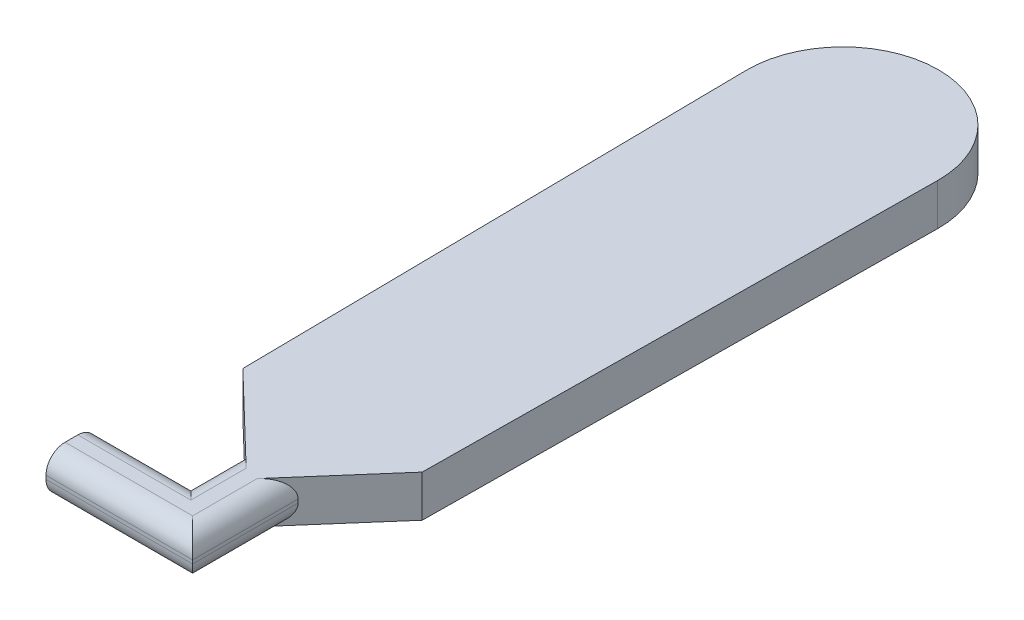
ISO-10303-21;
HEADER;
FILE_DESCRIPTION(('STEP AP214'),'2;1');
FILE_NAME('part.step','',(''),(''),'','','');
FILE_SCHEMA(('AUTOMOTIVE_DESIGN { 1 0 10303 214 1 1 1 1 }'));
ENDSEC;
DATA;
#1=APPLICATION_CONTEXT('core data for automotive mechanical design processes');
#2=APPLICATION_PROTOCOL_DEFINITION('international standard','automotive_design',2000,#1);
#3=PRODUCT_CONTEXT('',#1,'mechanical');
#4=PRODUCT('Part','Part','',(#3));
#5=PRODUCT_RELATED_PRODUCT_CATEGORY('part','',(#4));
#6=PRODUCT_DEFINITION_FORMATION('','',#4);
#7=PRODUCT_DEFINITION_CONTEXT('part definition',#1,'design');
#8=PRODUCT_DEFINITION('design','',#6,#7);
#9=PRODUCT_DEFINITION_SHAPE('','',#8);
#10=(LENGTH_UNIT() NAMED_UNIT(*) SI_UNIT(.MILLI.,.METRE.));
#11=(NAMED_UNIT(*) PLANE_ANGLE_UNIT() SI_UNIT($,.RADIAN.));
#12=(NAMED_UNIT(*) SI_UNIT($,.STERADIAN.) SOLID_ANGLE_UNIT());
#13=UNCERTAINTY_MEASURE_WITH_UNIT(LENGTH_MEASURE(1.E-05),#10,'distance_accuracy_value','');
#14=(GEOMETRIC_REPRESENTATION_CONTEXT(3) GLOBAL_UNCERTAINTY_ASSIGNED_CONTEXT((#13)) GLOBAL_UNIT_ASSIGNED_CONTEXT((#10,
#11,#12)) REPRESENTATION_CONTEXT('',''));
#15=CARTESIAN_POINT('',(0.,0.,0.));
#16=DIRECTION('',(0.,0.,1.));
#17=DIRECTION('',(1.,0.,0.));
#18=AXIS2_PLACEMENT_3D('',#15,#16,#17);
#19=CARTESIAN_POINT('',(8.67320172340913,10.,-0.111731628823776));
#20=DIRECTION('',(-0.999917032248953,0.,0.0128813282873694));
#21=DIRECTION('',(0.0128813282873694,0.,0.999917032248953));
#22=AXIS2_PLACEMENT_3D('',#19,#20,#21);
#23=PLANE('',#22);
#24=DIRECTION('',(-0.0128813282873694,0.,-0.999917032248953));
#25=VECTOR('',#24,1.);
#26=CARTESIAN_POINT('',(8.67320172340913,0.,-0.111731628823776));
#27=LINE('',#26,#25);
#28=CARTESIAN_POINT('',(7.67302590939626,0.,-77.7506838675886));
#29=VERTEX_POINT('',#28);
#30=CARTESIAN_POINT('',(6.09883614107377,0.,-199.947644167181));
#31=VERTEX_POINT('',#30);
#32=EDGE_CURVE('E163',#29,#31,#27,.T.);
#33=ORIENTED_EDGE('',*,*,#32,.F.);
#34=DIRECTION('',(0.,-1.,0.));
#35=VECTOR('',#34,1.);
#36=CARTESIAN_POINT('',(7.67302590939626,10.,-77.7506838675886));
#37=LINE('',#36,#35);
#38=CARTESIAN_POINT('',(7.67302590939626,10.,-77.7506838675886));
#39=VERTEX_POINT('',#38);
#40=EDGE_CURVE('E158',#39,#29,#37,.T.);
#41=ORIENTED_EDGE('',*,*,#40,.F.);
#42=DIRECTION('',(-0.0128813282873694,0.,-0.999917032248953));
#43=VECTOR('',#42,1.);
#44=CARTESIAN_POINT('',(8.67320172340913,10.,-0.111731628823776));
#45=LINE('',#44,#43);
#46=CARTESIAN_POINT('',(6.09883614107377,10.,-199.947644167181));
#47=VERTEX_POINT('',#46);
#48=EDGE_CURVE('E161',#39,#47,#45,.T.);
#49=ORIENTED_EDGE('',*,*,#48,.T.);
#50=DIRECTION('',(0.,-1.,0.));
#51=VECTOR('',#50,1.);
#52=CARTESIAN_POINT('',(6.09883614107377,10.,-199.947644167181));
#53=LINE('',#52,#51);
#54=EDGE_CURVE('E195',#47,#31,#53,.T.);
#55=ORIENTED_EDGE('',*,*,#54,.T.);
#56=EDGE_LOOP('',(#33,#41,#49,#55));
#57=FACE_BOUND('',#56,.T.);
#58=ADVANCED_FACE('F43',(#57),#23,.T.);
#59=CARTESIAN_POINT('',(42.5354193090019,10.,-44.2050407153228));
#60=DIRECTION('',(0.693367619628063,0.,-0.720584029833658));
#61=DIRECTION('',(-0.720584029833658,0.,-0.693367619628063));
#62=AXIS2_PLACEMENT_3D('',#59,#60,#61);
#63=PLANE('',#62);
#64=DIRECTION('',(0.720584029833658,0.,0.693367619628063));
#65=VECTOR('',#64,1.);
#66=CARTESIAN_POINT('',(42.5354193090019,0.,-44.2050407153228));
#67=LINE('',#66,#65);
#68=CARTESIAN_POINT('',(28.76441124198,0.,-57.4559187364662));
#69=VERTEX_POINT('',#68);
#70=EDGE_CURVE('E197',#29,#69,#67,.T.);
#71=ORIENTED_EDGE('',*,*,#70,.T.);
#72=CARTESIAN_POINT('',(28.76441124198,4.572,-57.4559187364662));
#73=DIRECTION('',(0.693367619628063,0.,-0.720584029833658));
#74=DIRECTION('',(0.720584029833658,0.,0.693367619628063));
#75=AXIS2_PLACEMENT_3D('',#72,#73,#74);
#76=ELLIPSE('',#75,6.34485335604151,4.572);
#77=CARTESIAN_POINT('',(24.19241124198,4.572,-61.8552346048338));
#78=VERTEX_POINT('',#77);
#79=EDGE_CURVE('E52',#69,#78,#76,.T.);
#80=ORIENTED_EDGE('',*,*,#79,.T.);
#81=DIRECTION('',(0.,-1.,0.));
#82=VECTOR('',#81,1.);
#83=CARTESIAN_POINT('',(24.19241124198,10.,-61.8552346048338));
#84=LINE('',#83,#82);
#85=CARTESIAN_POINT('',(24.19241124198,5.428,-61.8552346048338));
#86=VERTEX_POINT('',#85);
#87=EDGE_CURVE('E166',#86,#78,#84,.T.);
#88=ORIENTED_EDGE('',*,*,#87,.F.);
#89=CARTESIAN_POINT('',(28.76441124198,5.428,-57.4559187364662));
#90=DIRECTION('',(0.693367619628063,0.,-0.720584029833658));
#91=DIRECTION('',(-0.720584029833658,0.,-0.693367619628063));
#92=AXIS2_PLACEMENT_3D('',#89,#90,#91);
#93=ELLIPSE('',#92,6.34485335604151,4.572);
#94=CARTESIAN_POINT('',(28.76441124198,10.,-57.4559187364662));
#95=VERTEX_POINT('',#94);
#96=EDGE_CURVE('E11',#86,#95,#93,.T.);
#97=ORIENTED_EDGE('',*,*,#96,.T.);
#98=DIRECTION('',(0.720584029833658,0.,0.693367619628063));
#99=VECTOR('',#98,1.);
#100=CARTESIAN_POINT('',(42.5354193090019,10.,-44.2050407153228));
#101=LINE('',#100,#99);
#102=EDGE_CURVE('E168',#39,#95,#101,.T.);
#103=ORIENTED_EDGE('',*,*,#102,.F.);
#104=ORIENTED_EDGE('',*,*,#40,.T.);
#105=EDGE_LOOP('',(#71,#80,#88,#97,#103,#104));
#106=FACE_BOUND('',#105,.T.);
#107=ADVANCED_FACE('F169',(#106),#63,.F.);
#108=CARTESIAN_POINT('',(24.19241124198,10.,0.));
#109=DIRECTION('',(1.,0.,0.));
#110=DIRECTION('',(0.,0.,-1.));
#111=AXIS2_PLACEMENT_3D('',#108,#109,#110);
#112=PLANE('',#111);
#113=ORIENTED_EDGE('',*,*,#87,.T.);
#114=DIRECTION('',(0.,0.,1.));
#115=VECTOR('',#114,1.);
#116=CARTESIAN_POINT('',(24.19241124198,4.572,0.));
#117=LINE('',#116,#115);
#118=CARTESIAN_POINT('',(24.19241124198,4.572,-48.7662679513612));
#119=VERTEX_POINT('',#118);
#120=EDGE_CURVE('E265',#78,#119,#117,.T.);
#121=ORIENTED_EDGE('',*,*,#120,.T.);
#122=DIRECTION('',(0.,-1.,0.));
#123=VECTOR('',#122,1.);
#124=CARTESIAN_POINT('',(24.19241124198,10.,-48.7662679513612));
#125=LINE('',#124,#123);
#126=CARTESIAN_POINT('',(24.19241124198,5.428,-48.7662679513612));
#127=VERTEX_POINT('',#126);
#128=EDGE_CURVE('E225',#127,#119,#125,.T.);
#129=ORIENTED_EDGE('',*,*,#128,.F.);
#130=DIRECTION('',(0.,0.,1.));
#131=VECTOR('',#130,1.);
#132=CARTESIAN_POINT('',(24.19241124198,5.428,-61.8552346048338));
#133=LINE('',#132,#131);
#134=EDGE_CURVE('E66',#127,#86,#133,.F.);
#135=ORIENTED_EDGE('',*,*,#134,.T.);
#136=EDGE_LOOP('',(#113,#121,#129,#135));
#137=FACE_BOUND('',#136,.T.);
#138=ADVANCED_FACE('F337',(#137),#112,.F.);
#139=CARTESIAN_POINT('',(0.,10.,-48.7662679513612));
#140=DIRECTION('',(0.,0.,1.));
#141=DIRECTION('',(1.,0.,0.));
#142=AXIS2_PLACEMENT_3D('',#139,#140,#141);
#143=PLANE('',#142);
#144=ORIENTED_EDGE('',*,*,#128,.T.);
#145=DIRECTION('',(-1.,0.,0.));
#146=VECTOR('',#145,1.);
#147=CARTESIAN_POINT('',(0.,4.572,-48.7662679513612));
#148=LINE('',#147,#146);
#149=CARTESIAN_POINT('',(1.67291809905842,4.572,-48.7662679513612));
#150=VERTEX_POINT('',#149);
#151=EDGE_CURVE('E270',#119,#150,#148,.T.);
#152=ORIENTED_EDGE('',*,*,#151,.T.);
#153=DIRECTION('',(0.,-1.,0.));
#154=VECTOR('',#153,1.);
#155=CARTESIAN_POINT('',(1.67291809905842,10.,-48.7662679513612));
#156=LINE('',#155,#154);
#157=CARTESIAN_POINT('',(1.67291809905842,5.428,-48.7662679513612));
#158=VERTEX_POINT('',#157);
#159=EDGE_CURVE('E222',#158,#150,#156,.T.);
#160=ORIENTED_EDGE('',*,*,#159,.F.);
#161=DIRECTION('',(-1.,0.,0.));
#162=VECTOR('',#161,1.);
#163=CARTESIAN_POINT('',(24.19241124198,5.428,-48.7662679513612));
#164=LINE('',#163,#162);
#165=EDGE_CURVE('E268',#158,#127,#164,.F.);
#166=ORIENTED_EDGE('',*,*,#165,.T.);
#167=EDGE_LOOP('',(#144,#152,#160,#166));
#168=FACE_BOUND('',#167,.T.);
#169=ADVANCED_FACE('F339',(#168),#143,.F.);
#170=CARTESIAN_POINT('',(1.67291809905842,10.,0.));
#171=DIRECTION('',(1.,0.,0.));
#172=DIRECTION('',(0.,0.,-1.));
#173=AXIS2_PLACEMENT_3D('',#170,#171,#172);
#174=PLANE('',#173);
#175=DIRECTION('',(0.,-1.,0.));
#176=VECTOR('',#175,1.);
#177=CARTESIAN_POINT('',(1.67291809905842,10.,-36.5645685473484));
#178=LINE('',#177,#176);
#179=CARTESIAN_POINT('',(1.67291809905842,5.428,-36.5645685473484));
#180=VERTEX_POINT('',#179);
#181=CARTESIAN_POINT('',(1.67291809905842,4.572,-36.5645685473484));
#182=VERTEX_POINT('',#181);
#183=EDGE_CURVE('E219',#180,#182,#178,.T.);
#184=ORIENTED_EDGE('',*,*,#183,.F.);
#185=CARTESIAN_POINT('',(1.67291809905842,5.428,-41.1365685473484));
#186=DIRECTION('',(1.,0.,0.));
#187=DIRECTION('',(0.,0.,-1.));
#188=AXIS2_PLACEMENT_3D('',#185,#186,#187);
#189=CIRCLE('',#188,4.572);
#190=CARTESIAN_POINT('',(1.67291809905842,10.,-41.1365685473484));
#191=VERTEX_POINT('',#190);
#192=EDGE_CURVE('E249',#180,#191,#189,.F.);
#193=ORIENTED_EDGE('',*,*,#192,.T.);
#194=DIRECTION('',(0.,0.,1.));
#195=VECTOR('',#194,1.);
#196=CARTESIAN_POINT('',(1.67291809905842,10.,0.));
#197=LINE('',#196,#195);
#198=CARTESIAN_POINT('',(1.67291809905842,10.,-44.1942679513612));
#199=VERTEX_POINT('',#198);
#200=EDGE_CURVE('E174',#199,#191,#197,.T.);
#201=ORIENTED_EDGE('',*,*,#200,.F.);
#202=CARTESIAN_POINT('',(1.67291809905842,5.428,-44.1942679513612));
#203=DIRECTION('',(1.,0.,0.));
#204=DIRECTION('',(0.,0.,-1.));
#205=AXIS2_PLACEMENT_3D('',#202,#203,#204);
#206=CIRCLE('',#205,4.572);
#207=EDGE_CURVE('E243',#199,#158,#206,.F.);
#208=ORIENTED_EDGE('',*,*,#207,.T.);
#209=ORIENTED_EDGE('',*,*,#159,.T.);
#210=CARTESIAN_POINT('',(1.67291809905842,4.572,-44.1942679513612));
#211=DIRECTION('',(1.,0.,0.));
#212=DIRECTION('',(0.,0.,-1.));
#213=AXIS2_PLACEMENT_3D('',#210,#211,#212);
#214=CIRCLE('',#213,4.572);
#215=CARTESIAN_POINT('',(1.67291809905842,0.,-44.1942679513612));
#216=VERTEX_POINT('',#215);
#217=EDGE_CURVE('E245',#150,#216,#214,.F.);
#218=ORIENTED_EDGE('',*,*,#217,.T.);
#219=DIRECTION('',(0.,0.,1.));
#220=VECTOR('',#219,1.);
#221=CARTESIAN_POINT('',(1.67291809905842,0.,0.));
#222=LINE('',#221,#220);
#223=CARTESIAN_POINT('',(1.67291809905842,0.,-41.1365685473484));
#224=VERTEX_POINT('',#223);
#225=EDGE_CURVE('E200',#216,#224,#222,.T.);
#226=ORIENTED_EDGE('',*,*,#225,.T.);
#227=CARTESIAN_POINT('',(1.67291809905842,4.572,-41.1365685473484));
#228=DIRECTION('',(1.,0.,0.));
#229=DIRECTION('',(0.,0.,-1.));
#230=AXIS2_PLACEMENT_3D('',#227,#228,#229);
#231=CIRCLE('',#230,4.572);
#232=EDGE_CURVE('E247',#224,#182,#231,.F.);
#233=ORIENTED_EDGE('',*,*,#232,.T.);
#234=EDGE_LOOP('',(#184,#193,#201,#208,#209,#218,#226,#233));
#235=FACE_BOUND('',#234,.T.);
#236=ADVANCED_FACE('F297',(#235),#174,.F.);
#237=CARTESIAN_POINT('',(0.,10.,-36.5645685473484));
#238=DIRECTION('',(0.,0.,-1.));
#239=DIRECTION('',(-1.,0.,0.));
#240=AXIS2_PLACEMENT_3D('',#237,#238,#239);
#241=PLANE('',#240);
#242=DIRECTION('',(0.,-1.,0.));
#243=VECTOR('',#242,1.);
#244=CARTESIAN_POINT('',(36.8166245477847,10.,-36.5645685473484));
#245=LINE('',#244,#243);
#246=CARTESIAN_POINT('',(36.8166245477847,5.428,-36.5645685473484));
#247=VERTEX_POINT('',#246);
#248=CARTESIAN_POINT('',(36.8166245477847,4.572,-36.5645685473484));
#249=VERTEX_POINT('',#248);
#250=EDGE_CURVE('E216',#247,#249,#245,.T.);
#251=ORIENTED_EDGE('',*,*,#250,.F.);
#252=DIRECTION('',(1.,0.,0.));
#253=VECTOR('',#252,1.);
#254=CARTESIAN_POINT('',(1.67291809905842,5.428,-36.5645685473484));
#255=LINE('',#254,#253);
#256=EDGE_CURVE('E241',#247,#180,#255,.F.);
#257=ORIENTED_EDGE('',*,*,#256,.T.);
#258=ORIENTED_EDGE('',*,*,#183,.T.);
#259=DIRECTION('',(1.,0.,0.));
#260=VECTOR('',#259,1.);
#261=CARTESIAN_POINT('',(0.,4.572,-36.5645685473484));
#262=LINE('',#261,#260);
#263=EDGE_CURVE('E238',#182,#249,#262,.T.);
#264=ORIENTED_EDGE('',*,*,#263,.T.);
#265=EDGE_LOOP('',(#251,#257,#258,#264));
#266=FACE_BOUND('',#265,.T.);
#267=ADVANCED_FACE('F324',(#266),#241,.F.);
#268=CARTESIAN_POINT('',(36.8166245477847,10.,0.));
#269=DIRECTION('',(-1.,0.,0.));
#270=DIRECTION('',(0.,0.,1.));
#271=AXIS2_PLACEMENT_3D('',#268,#269,#270);
#272=PLANE('',#271);
#273=DIRECTION('',(0.,-1.,0.));
#274=VECTOR('',#273,1.);
#275=CARTESIAN_POINT('',(36.8166245477847,10.,-61.8552346048338));
#276=LINE('',#275,#274);
#277=CARTESIAN_POINT('',(36.8166245477847,5.428,-61.8552346048338));
#278=VERTEX_POINT('',#277);
#279=CARTESIAN_POINT('',(36.8166245477847,4.572,-61.8552346048338));
#280=VERTEX_POINT('',#279);
#281=EDGE_CURVE('E213',#278,#280,#276,.T.);
#282=ORIENTED_EDGE('',*,*,#281,.F.);
#283=DIRECTION('',(0.,0.,-1.));
#284=VECTOR('',#283,1.);
#285=CARTESIAN_POINT('',(36.8166245477847,5.428,-36.5645685473484));
#286=LINE('',#285,#284);
#287=EDGE_CURVE('E262',#278,#247,#286,.F.);
#288=ORIENTED_EDGE('',*,*,#287,.T.);
#289=ORIENTED_EDGE('',*,*,#250,.T.);
#290=DIRECTION('',(0.,0.,-1.));
#291=VECTOR('',#290,1.);
#292=CARTESIAN_POINT('',(36.8166245477847,4.572,0.));
#293=LINE('',#292,#291);
#294=EDGE_CURVE('E260',#249,#280,#293,.T.);
#295=ORIENTED_EDGE('',*,*,#294,.T.);
#296=EDGE_LOOP('',(#282,#288,#289,#295));
#297=FACE_BOUND('',#296,.T.);
#298=ADVANCED_FACE('F315',(#297),#272,.F.);
#299=CARTESIAN_POINT('',(-9.72544141948012,10.,-8.48044875271906));
#300=DIRECTION('',(-0.753701371654878,0.,-0.65721704357507));
#301=DIRECTION('',(-0.65721704357507,0.,0.753701371654878));
#302=AXIS2_PLACEMENT_3D('',#299,#300,#301);
#303=PLANE('',#302);
#304=DIRECTION('',(0.65721704357507,0.,-0.753701371654878));
#305=VECTOR('',#304,1.);
#306=CARTESIAN_POINT('',(-9.72544141948012,0.,-8.48044875271906));
#307=LINE('',#306,#305);
#308=CARTESIAN_POINT('',(32.2446245477847,0.,-56.6120311534119));
#309=VERTEX_POINT('',#308);
#310=CARTESIAN_POINT('',(50.677233754091,0.,-77.7506838675886));
#311=VERTEX_POINT('',#310);
#312=EDGE_CURVE('E203',#309,#311,#307,.T.);
#313=ORIENTED_EDGE('',*,*,#312,.T.);
#314=DIRECTION('',(0.,-1.,0.));
#315=VECTOR('',#314,1.);
#316=CARTESIAN_POINT('',(50.677233754091,10.,-77.7506838675886));
#317=LINE('',#316,#315);
#318=CARTESIAN_POINT('',(50.677233754091,10.,-77.7506838675886));
#319=VERTEX_POINT('',#318);
#320=EDGE_CURVE('E211',#319,#311,#317,.T.);
#321=ORIENTED_EDGE('',*,*,#320,.F.);
#322=DIRECTION('',(0.65721704357507,0.,-0.753701371654878));
#323=VECTOR('',#322,1.);
#324=CARTESIAN_POINT('',(-9.72544141948012,10.,-8.48044875271906));
#325=LINE('',#324,#323);
#326=CARTESIAN_POINT('',(32.2446245477847,10.,-56.6120311534119));
#327=VERTEX_POINT('',#326);
#328=EDGE_CURVE('E189',#327,#319,#325,.T.);
#329=ORIENTED_EDGE('',*,*,#328,.F.);
#330=CARTESIAN_POINT('',(32.2446245477847,5.428,-56.6120311534119));
#331=DIRECTION('',(-0.753701371654878,0.,-0.65721704357507));
#332=DIRECTION('',(-0.65721704357507,0.,0.753701371654878));
#333=AXIS2_PLACEMENT_3D('',#330,#331,#332);
#334=ELLIPSE('',#333,6.9566059564275,4.572);
#335=EDGE_CURVE('E272',#327,#278,#334,.T.);
#336=ORIENTED_EDGE('',*,*,#335,.T.);
#337=ORIENTED_EDGE('',*,*,#281,.T.);
#338=CARTESIAN_POINT('',(32.2446245477847,4.572,-56.6120311534119));
#339=DIRECTION('',(-0.753701371654878,0.,-0.65721704357507));
#340=DIRECTION('',(0.65721704357507,0.,-0.753701371654878));
#341=AXIS2_PLACEMENT_3D('',#338,#339,#340);
#342=ELLIPSE('',#341,6.9566059564275,4.572);
#343=EDGE_CURVE('E274',#280,#309,#342,.T.);
#344=ORIENTED_EDGE('',*,*,#343,.T.);
#345=EDGE_LOOP('',(#313,#321,#329,#336,#337,#344));
#346=FACE_BOUND('',#345,.T.);
#347=ADVANCED_FACE('F312',(#346),#303,.F.);
#348=CARTESIAN_POINT('',(49.8783176600329,10.,0.509182961049452));
#349=DIRECTION('',(0.999947897304426,0.,0.0102079712213835));
#350=DIRECTION('',(0.0102079712213835,0.,-0.999947897304426));
#351=AXIS2_PLACEMENT_3D('',#348,#349,#350);
#352=PLANE('',#351);
#353=DIRECTION('',(-0.0102079712213835,0.,0.999947897304426));
#354=VECTOR('',#353,1.);
#355=CARTESIAN_POINT('',(49.8783176600329,0.,0.509182961049452));
#356=LINE('',#355,#354);
#357=CARTESIAN_POINT('',(51.925307170323,0.,-200.008903564416));
#358=VERTEX_POINT('',#357);
#359=EDGE_CURVE('E185',#358,#311,#356,.T.);
#360=ORIENTED_EDGE('',*,*,#359,.F.);
#361=DIRECTION('',(0.,-1.,0.));
#362=VECTOR('',#361,1.);
#363=CARTESIAN_POINT('',(51.925307170323,10.,-200.008903564416));
#364=LINE('',#363,#362);
#365=CARTESIAN_POINT('',(51.925307170323,10.,-200.008903564416));
#366=VERTEX_POINT('',#365);
#367=EDGE_CURVE('E209',#366,#358,#364,.T.);
#368=ORIENTED_EDGE('',*,*,#367,.F.);
#369=DIRECTION('',(-0.0102079712213835,0.,0.999947897304426));
#370=VECTOR('',#369,1.);
#371=CARTESIAN_POINT('',(49.8783176600329,10.,0.509182961049452));
#372=LINE('',#371,#370);
#373=EDGE_CURVE('E191',#366,#319,#372,.T.);
#374=ORIENTED_EDGE('',*,*,#373,.T.);
#375=ORIENTED_EDGE('',*,*,#320,.T.);
#376=EDGE_LOOP('',(#360,#368,#374,#375));
#377=FACE_BOUND('',#376,.T.);
#378=ADVANCED_FACE('F426',(#377),#352,.T.);
#379=CARTESIAN_POINT('',(29.0117180226731,10.,-200.242817010535));
#380=DIRECTION('',(0.,-1.,0.));
#381=DIRECTION('',(0.,0.,-1.));
#382=AXIS2_PLACEMENT_3D('',#379,#380,#381);
#383=CYLINDRICAL_SURFACE('',#382,22.9147830696163);
#384=CARTESIAN_POINT('',(29.0117180226731,0.,-200.242817010535));
#385=DIRECTION('',(0.,1.,0.));
#386=DIRECTION('',(0.,0.,1.));
#387=AXIS2_PLACEMENT_3D('',#384,#385,#386);
#388=CIRCLE('',#387,22.9147830696163);
#389=EDGE_CURVE('E182',#358,#31,#388,.T.);
#390=ORIENTED_EDGE('',*,*,#389,.T.);
#391=ORIENTED_EDGE('',*,*,#54,.F.);
#392=CARTESIAN_POINT('',(29.0117180226731,10.,-200.242817010535));
#393=DIRECTION('',(0.,1.,0.));
#394=DIRECTION('',(0.,0.,1.));
#395=AXIS2_PLACEMENT_3D('',#392,#393,#394);
#396=CIRCLE('',#395,22.9147830696163);
#397=EDGE_CURVE('E180',#366,#47,#396,.T.);
#398=ORIENTED_EDGE('',*,*,#397,.F.);
#399=ORIENTED_EDGE('',*,*,#367,.T.);
#400=EDGE_LOOP('',(#390,#391,#398,#399));
#401=FACE_BOUND('',#400,.T.);
#402=ADVANCED_FACE('F417',(#401),#383,.T.);
#403=CARTESIAN_POINT('',(0.,10.,0.));
#404=DIRECTION('',(0.,1.,0.));
#405=DIRECTION('',(0.,0.,1.));
#406=AXIS2_PLACEMENT_3D('',#403,#404,#405);
#407=PLANE('',#406);
#408=ORIENTED_EDGE('',*,*,#200,.T.);
#409=DIRECTION('',(1.,0.,0.));
#410=VECTOR('',#409,1.);
#411=CARTESIAN_POINT('',(36.8166245477847,10.,-41.1365685473484));
#412=LINE('',#411,#410);
#413=CARTESIAN_POINT('',(32.2446245477847,10.,-41.1365685473484));
#414=VERTEX_POINT('',#413);
#415=EDGE_CURVE('E235',#191,#414,#412,.T.);
#416=ORIENTED_EDGE('',*,*,#415,.T.);
#417=DIRECTION('',(0.,0.,-1.));
#418=VECTOR('',#417,1.);
#419=CARTESIAN_POINT('',(32.2446245477847,10.,-61.8552346048338));
#420=LINE('',#419,#418);
#421=EDGE_CURVE('E232',#414,#327,#420,.T.);
#422=ORIENTED_EDGE('',*,*,#421,.T.);
#423=ORIENTED_EDGE('',*,*,#328,.T.);
#424=ORIENTED_EDGE('',*,*,#373,.F.);
#425=ORIENTED_EDGE('',*,*,#397,.T.);
#426=ORIENTED_EDGE('',*,*,#48,.F.);
#427=ORIENTED_EDGE('',*,*,#102,.T.);
#428=DIRECTION('',(0.,0.,1.));
#429=VECTOR('',#428,1.);
#430=CARTESIAN_POINT('',(28.76441124198,10.,-48.7662679513612));
#431=LINE('',#430,#429);
#432=CARTESIAN_POINT('',(28.76441124198,10.,-44.1942679513612));
#433=VERTEX_POINT('',#432);
#434=EDGE_CURVE('E230',#95,#433,#431,.T.);
#435=ORIENTED_EDGE('',*,*,#434,.T.);
#436=DIRECTION('',(-1.,0.,0.));
#437=VECTOR('',#436,1.);
#438=CARTESIAN_POINT('',(1.67291809905842,10.,-44.1942679513612));
#439=LINE('',#438,#437);
#440=EDGE_CURVE('E165',#433,#199,#439,.T.);
#441=ORIENTED_EDGE('',*,*,#440,.T.);
#442=EDGE_LOOP('',(#408,#416,#422,#423,#424,#425,#426,#427,#435,#441));
#443=FACE_BOUND('',#442,.T.);
#444=ADVANCED_FACE('F177',(#443),#407,.T.);
#445=CARTESIAN_POINT('',(0.,0.,0.));
#446=DIRECTION('',(0.,1.,0.));
#447=DIRECTION('',(0.,0.,1.));
#448=AXIS2_PLACEMENT_3D('',#445,#446,#447);
#449=PLANE('',#448);
#450=DIRECTION('',(0.,0.,-1.));
#451=VECTOR('',#450,1.);
#452=CARTESIAN_POINT('',(32.2446245477847,0.,0.));
#453=LINE('',#452,#451);
#454=CARTESIAN_POINT('',(32.2446245477847,0.,-41.1365685473484));
#455=VERTEX_POINT('',#454);
#456=EDGE_CURVE('E256',#309,#455,#453,.F.);
#457=ORIENTED_EDGE('',*,*,#456,.T.);
#458=DIRECTION('',(1.,0.,0.));
#459=VECTOR('',#458,1.);
#460=CARTESIAN_POINT('',(0.,0.,-41.1365685473484));
#461=LINE('',#460,#459);
#462=EDGE_CURVE('E258',#455,#224,#461,.F.);
#463=ORIENTED_EDGE('',*,*,#462,.T.);
#464=ORIENTED_EDGE('',*,*,#225,.F.);
#465=DIRECTION('',(-1.,0.,0.));
#466=VECTOR('',#465,1.);
#467=CARTESIAN_POINT('',(0.,0.,-44.1942679513612));
#468=LINE('',#467,#466);
#469=CARTESIAN_POINT('',(28.76441124198,0.,-44.1942679513612));
#470=VERTEX_POINT('',#469);
#471=EDGE_CURVE('E251',#216,#470,#468,.F.);
#472=ORIENTED_EDGE('',*,*,#471,.T.);
#473=DIRECTION('',(0.,0.,1.));
#474=VECTOR('',#473,1.);
#475=CARTESIAN_POINT('',(28.76441124198,0.,0.));
#476=LINE('',#475,#474);
#477=EDGE_CURVE('E253',#470,#69,#476,.F.);
#478=ORIENTED_EDGE('',*,*,#477,.T.);
#479=ORIENTED_EDGE('',*,*,#70,.F.);
#480=ORIENTED_EDGE('',*,*,#32,.T.);
#481=ORIENTED_EDGE('',*,*,#389,.F.);
#482=ORIENTED_EDGE('',*,*,#359,.T.);
#483=ORIENTED_EDGE('',*,*,#312,.F.);
#484=EDGE_LOOP('',(#457,#463,#464,#472,#478,#479,#480,#481,#482,#483));
#485=FACE_BOUND('',#484,.T.);
#486=ADVANCED_FACE('F331',(#485),#449,.F.);
#487=CARTESIAN_POINT('',(32.2446245477847,5.428,0.));
#488=DIRECTION('',(0.,0.,1.));
#489=DIRECTION('',(1.,0.,0.));
#490=AXIS2_PLACEMENT_3D('',#487,#488,#489);
#491=CYLINDRICAL_SURFACE('',#490,4.572);
#492=ORIENTED_EDGE('',*,*,#335,.F.);
#493=ORIENTED_EDGE('',*,*,#421,.F.);
#494=CARTESIAN_POINT('',(32.2446245477847,5.428,-41.1365685473484));
#495=DIRECTION('',(-0.707106781186547,0.,0.707106781186547));
#496=DIRECTION('',(0.707106781186547,0.,0.707106781186547));
#497=AXIS2_PLACEMENT_3D('',#494,#495,#496);
#498=ELLIPSE('',#497,6.46578440716979,4.572);
#499=EDGE_CURVE('E198',#247,#414,#498,.T.);
#500=ORIENTED_EDGE('',*,*,#499,.F.);
#501=ORIENTED_EDGE('',*,*,#287,.F.);
#502=EDGE_LOOP('',(#492,#493,#500,#501));
#503=FACE_BOUND('',#502,.T.);
#504=ADVANCED_FACE('F309',(#503),#491,.T.);
#505=CARTESIAN_POINT('',(0.,5.428,-41.1365685473484));
#506=DIRECTION('',(-1.,0.,0.));
#507=DIRECTION('',(0.,0.,1.));
#508=AXIS2_PLACEMENT_3D('',#505,#506,#507);
#509=CYLINDRICAL_SURFACE('',#508,4.572);
#510=ORIENTED_EDGE('',*,*,#192,.F.);
#511=ORIENTED_EDGE('',*,*,#256,.F.);
#512=ORIENTED_EDGE('',*,*,#499,.T.);
#513=ORIENTED_EDGE('',*,*,#415,.F.);
#514=EDGE_LOOP('',(#510,#511,#512,#513));
#515=FACE_BOUND('',#514,.T.);
#516=ADVANCED_FACE('F302',(#515),#509,.T.);
#517=CARTESIAN_POINT('',(32.2446245477847,4.572,0.));
#518=DIRECTION('',(0.,0.,-1.));
#519=DIRECTION('',(-1.,0.,0.));
#520=AXIS2_PLACEMENT_3D('',#517,#518,#519);
#521=CYLINDRICAL_SURFACE('',#520,4.572);
#522=ORIENTED_EDGE('',*,*,#343,.F.);
#523=ORIENTED_EDGE('',*,*,#294,.F.);
#524=CARTESIAN_POINT('',(32.2446245477847,4.572,-41.1365685473484));
#525=DIRECTION('',(0.707106781186547,0.,-0.707106781186547));
#526=DIRECTION('',(-0.707106781186547,0.,-0.707106781186547));
#527=AXIS2_PLACEMENT_3D('',#524,#525,#526);
#528=ELLIPSE('',#527,6.46578440716979,4.572);
#529=EDGE_CURVE('E279',#455,#249,#528,.F.);
#530=ORIENTED_EDGE('',*,*,#529,.F.);
#531=ORIENTED_EDGE('',*,*,#456,.F.);
#532=EDGE_LOOP('',(#522,#523,#530,#531));
#533=FACE_BOUND('',#532,.T.);
#534=ADVANCED_FACE('F320',(#533),#521,.T.);
#535=CARTESIAN_POINT('',(0.,4.572,-41.1365685473484));
#536=DIRECTION('',(1.,0.,0.));
#537=DIRECTION('',(0.,0.,-1.));
#538=AXIS2_PLACEMENT_3D('',#535,#536,#537);
#539=CYLINDRICAL_SURFACE('',#538,4.572);
#540=ORIENTED_EDGE('',*,*,#232,.F.);
#541=ORIENTED_EDGE('',*,*,#462,.F.);
#542=ORIENTED_EDGE('',*,*,#529,.T.);
#543=ORIENTED_EDGE('',*,*,#263,.F.);
#544=EDGE_LOOP('',(#540,#541,#542,#543));
#545=FACE_BOUND('',#544,.T.);
#546=ADVANCED_FACE('F327',(#545),#539,.T.);
#547=CARTESIAN_POINT('',(0.,4.572,-44.1942679513612));
#548=DIRECTION('',(-1.,0.,0.));
#549=DIRECTION('',(0.,0.,1.));
#550=AXIS2_PLACEMENT_3D('',#547,#548,#549);
#551=CYLINDRICAL_SURFACE('',#550,4.572);
#552=ORIENTED_EDGE('',*,*,#217,.F.);
#553=ORIENTED_EDGE('',*,*,#151,.F.);
#554=CARTESIAN_POINT('',(28.76441124198,4.572,-44.1942679513612));
#555=DIRECTION('',(-0.707106781186547,0.,0.707106781186547));
#556=DIRECTION('',(0.707106781186547,0.,0.707106781186547));
#557=AXIS2_PLACEMENT_3D('',#554,#555,#556);
#558=ELLIPSE('',#557,6.46578440716979,4.572);
#559=EDGE_CURVE('E280',#470,#119,#558,.F.);
#560=ORIENTED_EDGE('',*,*,#559,.F.);
#561=ORIENTED_EDGE('',*,*,#471,.F.);
#562=EDGE_LOOP('',(#552,#553,#560,#561));
#563=FACE_BOUND('',#562,.T.);
#564=ADVANCED_FACE('F335',(#563),#551,.T.);
#565=CARTESIAN_POINT('',(28.76441124198,4.572,0.));
#566=DIRECTION('',(0.,0.,1.));
#567=DIRECTION('',(1.,0.,0.));
#568=AXIS2_PLACEMENT_3D('',#565,#566,#567);
#569=CYLINDRICAL_SURFACE('',#568,4.572);
#570=ORIENTED_EDGE('',*,*,#79,.F.);
#571=ORIENTED_EDGE('',*,*,#477,.F.);
#572=ORIENTED_EDGE('',*,*,#559,.T.);
#573=ORIENTED_EDGE('',*,*,#120,.F.);
#574=EDGE_LOOP('',(#570,#571,#572,#573));
#575=FACE_BOUND('',#574,.T.);
#576=ADVANCED_FACE('F336',(#575),#569,.T.);
#577=CARTESIAN_POINT('',(0.,5.428,-44.1942679513612));
#578=DIRECTION('',(1.,0.,0.));
#579=DIRECTION('',(0.,0.,-1.));
#580=AXIS2_PLACEMENT_3D('',#577,#578,#579);
#581=CYLINDRICAL_SURFACE('',#580,4.572);
#582=ORIENTED_EDGE('',*,*,#207,.F.);
#583=ORIENTED_EDGE('',*,*,#440,.F.);
#584=CARTESIAN_POINT('',(28.76441124198,5.428,-44.1942679513612));
#585=DIRECTION('',(0.707106781186547,0.,-0.707106781186547));
#586=DIRECTION('',(-0.707106781186547,0.,-0.707106781186547));
#587=AXIS2_PLACEMENT_3D('',#584,#585,#586);
#588=ELLIPSE('',#587,6.46578440716979,4.572);
#589=EDGE_CURVE('E47',#127,#433,#588,.T.);
#590=ORIENTED_EDGE('',*,*,#589,.F.);
#591=ORIENTED_EDGE('',*,*,#165,.F.);
#592=EDGE_LOOP('',(#582,#583,#590,#591));
#593=FACE_BOUND('',#592,.T.);
#594=ADVANCED_FACE('F45',(#593),#581,.T.);
#595=CARTESIAN_POINT('',(28.76441124198,5.428,0.));
#596=DIRECTION('',(0.,0.,-1.));
#597=DIRECTION('',(-1.,0.,0.));
#598=AXIS2_PLACEMENT_3D('',#595,#596,#597);
#599=CYLINDRICAL_SURFACE('',#598,4.572);
#600=ORIENTED_EDGE('',*,*,#96,.F.);
#601=ORIENTED_EDGE('',*,*,#134,.F.);
#602=ORIENTED_EDGE('',*,*,#589,.T.);
#603=ORIENTED_EDGE('',*,*,#434,.F.);
#604=EDGE_LOOP('',(#600,#601,#602,#603));
#605=FACE_BOUND('',#604,.T.);
#606=ADVANCED_FACE('F289',(#605),#599,.T.);
#607=CLOSED_SHELL('',(#58,#107,#138,#169,#236,#267,#298,#347,#378,#402,#444,#486,#504,#516,#534,
#546,#564,#576,#594,#606));
#608=MANIFOLD_SOLID_BREP('B2',#607);
#609=ADVANCED_BREP_SHAPE_REPRESENTATION('',(#18,#608),#14);
#610=SHAPE_DEFINITION_REPRESENTATION(#9,#609);
ENDSEC;
END-ISO-10303-21;
